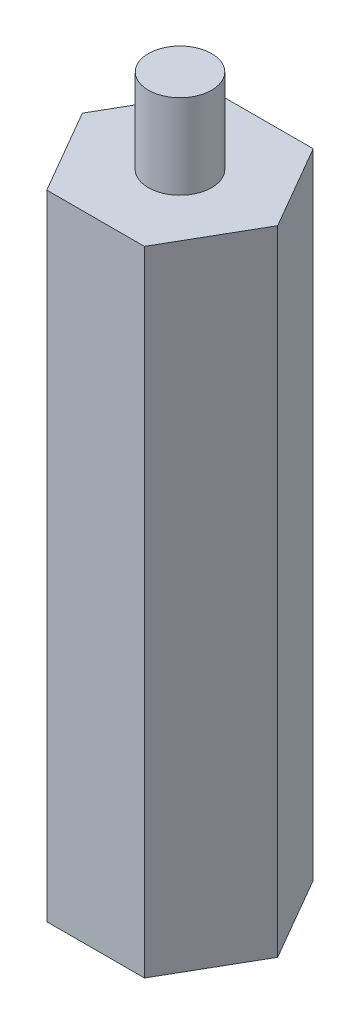
ISO-10303-21;
HEADER;
FILE_DESCRIPTION(('STEP AP214'),'2;1');
FILE_NAME('part.step','',(''),(''),'','','');
FILE_SCHEMA(('AUTOMOTIVE_DESIGN { 1 0 10303 214 1 1 1 1 }'));
ENDSEC;
DATA;
#1=APPLICATION_CONTEXT('core data for automotive mechanical design processes');
#2=APPLICATION_PROTOCOL_DEFINITION('international standard','automotive_design',2000,#1);
#3=PRODUCT_CONTEXT('',#1,'mechanical');
#4=PRODUCT('Part','Part','',(#3));
#5=PRODUCT_RELATED_PRODUCT_CATEGORY('part','',(#4));
#6=PRODUCT_DEFINITION_FORMATION('','',#4);
#7=PRODUCT_DEFINITION_CONTEXT('part definition',#1,'design');
#8=PRODUCT_DEFINITION('design','',#6,#7);
#9=PRODUCT_DEFINITION_SHAPE('','',#8);
#10=(LENGTH_UNIT() NAMED_UNIT(*) SI_UNIT(.MILLI.,.METRE.));
#11=(NAMED_UNIT(*) PLANE_ANGLE_UNIT() SI_UNIT($,.RADIAN.));
#12=(NAMED_UNIT(*) SI_UNIT($,.STERADIAN.) SOLID_ANGLE_UNIT());
#13=UNCERTAINTY_MEASURE_WITH_UNIT(LENGTH_MEASURE(1.E-05),#10,'distance_accuracy_value','');
#14=(GEOMETRIC_REPRESENTATION_CONTEXT(3) GLOBAL_UNCERTAINTY_ASSIGNED_CONTEXT((#13)) GLOBAL_UNIT_ASSIGNED_CONTEXT((#10,
#11,#12)) REPRESENTATION_CONTEXT('',''));
#15=CARTESIAN_POINT('',(0.,0.,0.));
#16=DIRECTION('',(0.,0.,1.));
#17=DIRECTION('',(1.,0.,0.));
#18=AXIS2_PLACEMENT_3D('',#15,#16,#17);
#19=CARTESIAN_POINT('',(9.23759956461125,60.,-0.00936040743649841));
#20=DIRECTION('',(-0.865518312267944,0.,0.500877281506009));
#21=DIRECTION('',(0.500877281506009,0.,0.865518312267944));
#22=AXIS2_PLACEMENT_3D('',#19,#20,#21);
#23=PLANE('',#22);
#24=DIRECTION('',(-0.500877281506009,0.,-0.865518312267944));
#25=VECTOR('',#24,1.);
#26=CARTESIAN_POINT('',(9.23759956461125,0.,-0.00936040743649841));
#27=LINE('',#26,#25);
#28=CARTESIAN_POINT('',(9.23759956461125,0.,-0.00936040743649841));
#29=VERTEX_POINT('',#28);
#30=CARTESIAN_POINT('',(4.61069343167586,0.,-8.00467609665967));
#31=VERTEX_POINT('',#30);
#32=EDGE_CURVE('E122',#29,#31,#27,.T.);
#33=ORIENTED_EDGE('',*,*,#32,.T.);
#34=DIRECTION('',(0.,-1.,0.));
#35=VECTOR('',#34,1.);
#36=CARTESIAN_POINT('',(4.61069343167586,60.,-8.00467609665967));
#37=LINE('',#36,#35);
#38=CARTESIAN_POINT('',(4.61069343167586,60.,-8.00467609665967));
#39=VERTEX_POINT('',#38);
#40=EDGE_CURVE('E39',#39,#31,#37,.T.);
#41=ORIENTED_EDGE('',*,*,#40,.F.);
#42=DIRECTION('',(-0.500877281506009,0.,-0.865518312267944));
#43=VECTOR('',#42,1.);
#44=CARTESIAN_POINT('',(9.23759956461125,60.,-0.00936040743649841));
#45=LINE('',#44,#43);
#46=CARTESIAN_POINT('',(9.23759956461125,60.,-0.00936040743649841));
#47=VERTEX_POINT('',#46);
#48=EDGE_CURVE('E133',#47,#39,#45,.T.);
#49=ORIENTED_EDGE('',*,*,#48,.F.);
#50=DIRECTION('',(0.,-1.,0.));
#51=VECTOR('',#50,1.);
#52=CARTESIAN_POINT('',(9.23759956461125,60.,-0.00936040743649841));
#53=LINE('',#52,#51);
#54=EDGE_CURVE('E118',#47,#29,#53,.T.);
#55=ORIENTED_EDGE('',*,*,#54,.T.);
#56=EDGE_LOOP('',(#33,#41,#49,#55));
#57=FACE_BOUND('',#56,.T.);
#58=ADVANCED_FACE('F36',(#57),#23,.F.);
#59=CARTESIAN_POINT('',(4.61069343167586,60.,-8.00467609665967));
#60=DIRECTION('',(0.00101329382872134,0.,0.999999486617677));
#61=DIRECTION('',(0.999999486617677,0.,-0.00101329382872134));
#62=AXIS2_PLACEMENT_3D('',#59,#60,#61);
#63=PLANE('',#62);
#64=DIRECTION('',(-0.999999486617677,0.,0.00101329382872134));
#65=VECTOR('',#64,1.);
#66=CARTESIAN_POINT('',(4.61069343167586,0.,-8.00467609665967));
#67=LINE('',#66,#65);
#68=CARTESIAN_POINT('',(-4.62690613293537,0.,-7.99531568922318));
#69=VERTEX_POINT('',#68);
#70=EDGE_CURVE('E125',#31,#69,#67,.T.);
#71=ORIENTED_EDGE('',*,*,#70,.T.);
#72=DIRECTION('',(0.,-1.,0.));
#73=VECTOR('',#72,1.);
#74=CARTESIAN_POINT('',(-4.62690613293537,60.,-7.99531568922318));
#75=LINE('',#74,#73);
#76=CARTESIAN_POINT('',(-4.62690613293537,60.,-7.99531568922318));
#77=VERTEX_POINT('',#76);
#78=EDGE_CURVE('E136',#77,#69,#75,.T.);
#79=ORIENTED_EDGE('',*,*,#78,.F.);
#80=DIRECTION('',(-0.999999486617677,0.,0.00101329382872134));
#81=VECTOR('',#80,1.);
#82=CARTESIAN_POINT('',(4.61069343167586,60.,-8.00467609665967));
#83=LINE('',#82,#81);
#84=EDGE_CURVE('E91',#39,#77,#83,.T.);
#85=ORIENTED_EDGE('',*,*,#84,.F.);
#86=ORIENTED_EDGE('',*,*,#40,.T.);
#87=EDGE_LOOP('',(#71,#79,#85,#86));
#88=FACE_BOUND('',#87,.T.);
#89=ADVANCED_FACE('F141',(#88),#63,.F.);
#90=CARTESIAN_POINT('',(-4.62690613293537,60.,-7.99531568922318));
#91=DIRECTION('',(0.866531606096666,0.,0.499122205111667));
#92=DIRECTION('',(0.499122205111667,0.,-0.866531606096666));
#93=AXIS2_PLACEMENT_3D('',#90,#91,#92);
#94=PLANE('',#93);
#95=DIRECTION('',(-0.499122205111667,0.,0.866531606096666));
#96=VECTOR('',#95,1.);
#97=CARTESIAN_POINT('',(-4.62690613293537,0.,-7.99531568922318));
#98=LINE('',#97,#96);
#99=CARTESIAN_POINT('',(-9.23759956461123,0.,0.00936040743649058));
#100=VERTEX_POINT('',#99);
#101=EDGE_CURVE('E128',#69,#100,#98,.T.);
#102=ORIENTED_EDGE('',*,*,#101,.T.);
#103=DIRECTION('',(0.,-1.,0.));
#104=VECTOR('',#103,1.);
#105=CARTESIAN_POINT('',(-9.23759956461123,60.,0.00936040743649058));
#106=LINE('',#105,#104);
#107=CARTESIAN_POINT('',(-9.23759956461123,60.,0.00936040743649058));
#108=VERTEX_POINT('',#107);
#109=EDGE_CURVE('E113',#108,#100,#106,.T.);
#110=ORIENTED_EDGE('',*,*,#109,.F.);
#111=DIRECTION('',(-0.499122205111667,0.,0.866531606096666));
#112=VECTOR('',#111,1.);
#113=CARTESIAN_POINT('',(-4.62690613293537,60.,-7.99531568922318));
#114=LINE('',#113,#112);
#115=EDGE_CURVE('E104',#77,#108,#114,.T.);
#116=ORIENTED_EDGE('',*,*,#115,.F.);
#117=ORIENTED_EDGE('',*,*,#78,.T.);
#118=EDGE_LOOP('',(#102,#110,#116,#117));
#119=FACE_BOUND('',#118,.T.);
#120=ADVANCED_FACE('F147',(#119),#94,.F.);
#121=CARTESIAN_POINT('',(-9.23759956461123,60.,0.00936040743649058));
#122=DIRECTION('',(0.865518312267944,0.,-0.500877281506009));
#123=DIRECTION('',(-0.500877281506009,0.,-0.865518312267944));
#124=AXIS2_PLACEMENT_3D('',#121,#122,#123);
#125=PLANE('',#124);
#126=DIRECTION('',(0.500877281506009,0.,0.865518312267944));
#127=VECTOR('',#126,1.);
#128=CARTESIAN_POINT('',(-9.23759956461123,0.,0.00936040743649058));
#129=LINE('',#128,#127);
#130=CARTESIAN_POINT('',(-4.61069343167583,0.,8.00467609665967));
#131=VERTEX_POINT('',#130);
#132=EDGE_CURVE('E112',#100,#131,#129,.T.);
#133=ORIENTED_EDGE('',*,*,#132,.T.);
#134=DIRECTION('',(0.,-1.,0.));
#135=VECTOR('',#134,1.);
#136=CARTESIAN_POINT('',(-4.61069343167583,60.,8.00467609665967));
#137=LINE('',#136,#135);
#138=CARTESIAN_POINT('',(-4.61069343167583,60.,8.00467609665967));
#139=VERTEX_POINT('',#138);
#140=EDGE_CURVE('E109',#139,#131,#137,.T.);
#141=ORIENTED_EDGE('',*,*,#140,.F.);
#142=DIRECTION('',(0.500877281506009,0.,0.865518312267944));
#143=VECTOR('',#142,1.);
#144=CARTESIAN_POINT('',(-9.23759956461123,60.,0.00936040743649058));
#145=LINE('',#144,#143);
#146=EDGE_CURVE('E98',#108,#139,#145,.T.);
#147=ORIENTED_EDGE('',*,*,#146,.F.);
#148=ORIENTED_EDGE('',*,*,#109,.T.);
#149=EDGE_LOOP('',(#133,#141,#147,#148));
#150=FACE_BOUND('',#149,.T.);
#151=ADVANCED_FACE('F110',(#150),#125,.F.);
#152=CARTESIAN_POINT('',(-4.61069343167583,60.,8.00467609665967));
#153=DIRECTION('',(-0.00101329382872135,0.,-0.999999486617677));
#154=DIRECTION('',(-0.999999486617677,0.,0.00101329382872135));
#155=AXIS2_PLACEMENT_3D('',#152,#153,#154);
#156=PLANE('',#155);
#157=DIRECTION('',(0.999999486617677,0.,-0.00101329382872135));
#158=VECTOR('',#157,1.);
#159=CARTESIAN_POINT('',(-4.61069343167583,0.,8.00467609665967));
#160=LINE('',#159,#158);
#161=CARTESIAN_POINT('',(4.62690613293538,0.,7.99531568922318));
#162=VERTEX_POINT('',#161);
#163=EDGE_CURVE('E76',#131,#162,#160,.T.);
#164=ORIENTED_EDGE('',*,*,#163,.T.);
#165=DIRECTION('',(0.,-1.,0.));
#166=VECTOR('',#165,1.);
#167=CARTESIAN_POINT('',(4.62690613293538,60.,7.99531568922318));
#168=LINE('',#167,#166);
#169=CARTESIAN_POINT('',(4.62690613293538,60.,7.99531568922318));
#170=VERTEX_POINT('',#169);
#171=EDGE_CURVE('E114',#170,#162,#168,.T.);
#172=ORIENTED_EDGE('',*,*,#171,.F.);
#173=DIRECTION('',(0.999999486617677,0.,-0.00101329382872135));
#174=VECTOR('',#173,1.);
#175=CARTESIAN_POINT('',(-4.61069343167583,60.,8.00467609665967));
#176=LINE('',#175,#174);
#177=EDGE_CURVE('E102',#139,#170,#176,.T.);
#178=ORIENTED_EDGE('',*,*,#177,.F.);
#179=ORIENTED_EDGE('',*,*,#140,.T.);
#180=EDGE_LOOP('',(#164,#172,#178,#179));
#181=FACE_BOUND('',#180,.T.);
#182=ADVANCED_FACE('F116',(#181),#156,.F.);
#183=CARTESIAN_POINT('',(4.62690613293538,60.,7.99531568922318));
#184=DIRECTION('',(-0.866531606096665,0.,-0.499122205111668));
#185=DIRECTION('',(-0.499122205111668,0.,0.866531606096665));
#186=AXIS2_PLACEMENT_3D('',#183,#184,#185);
#187=PLANE('',#186);
#188=DIRECTION('',(0.499122205111668,0.,-0.866531606096665));
#189=VECTOR('',#188,1.);
#190=CARTESIAN_POINT('',(4.62690613293538,0.,7.99531568922318));
#191=LINE('',#190,#189);
#192=EDGE_CURVE('E82',#162,#29,#191,.T.);
#193=ORIENTED_EDGE('',*,*,#192,.T.);
#194=ORIENTED_EDGE('',*,*,#54,.F.);
#195=DIRECTION('',(0.499122205111668,0.,-0.866531606096665));
#196=VECTOR('',#195,1.);
#197=CARTESIAN_POINT('',(4.62690613293538,60.,7.99531568922318));
#198=LINE('',#197,#196);
#199=EDGE_CURVE('E53',#170,#47,#198,.T.);
#200=ORIENTED_EDGE('',*,*,#199,.F.);
#201=ORIENTED_EDGE('',*,*,#171,.T.);
#202=EDGE_LOOP('',(#193,#194,#200,#201));
#203=FACE_BOUND('',#202,.T.);
#204=ADVANCED_FACE('F178',(#203),#187,.F.);
#205=CARTESIAN_POINT('',(0.,60.,0.));
#206=DIRECTION('',(0.,1.,0.));
#207=DIRECTION('',(0.,0.,1.));
#208=AXIS2_PLACEMENT_3D('',#205,#206,#207);
#209=PLANE('',#208);
#210=CARTESIAN_POINT('',(0.,60.,0.));
#211=DIRECTION('',(0.,1.,0.));
#212=DIRECTION('',(0.,0.,1.));
#213=AXIS2_PLACEMENT_3D('',#210,#211,#212);
#214=CIRCLE('',#213,3.);
#215=CARTESIAN_POINT('',(0.,60.,3.));
#216=VERTEX_POINT('',#215);
#217=EDGE_CURVE('E11',#216,#216,#214,.T.);
#218=ORIENTED_EDGE('',*,*,#217,.F.);
#219=EDGE_LOOP('',(#218));
#220=FACE_BOUND('',#219,.T.);
#221=ORIENTED_EDGE('',*,*,#48,.T.);
#222=ORIENTED_EDGE('',*,*,#84,.T.);
#223=ORIENTED_EDGE('',*,*,#115,.T.);
#224=ORIENTED_EDGE('',*,*,#146,.T.);
#225=ORIENTED_EDGE('',*,*,#177,.T.);
#226=ORIENTED_EDGE('',*,*,#199,.T.);
#227=EDGE_LOOP('',(#221,#222,#223,#224,#225,#226));
#228=FACE_BOUND('',#227,.T.);
#229=ADVANCED_FACE('F100',(#220,#228),#209,.T.);
#230=CARTESIAN_POINT('',(0.,0.,0.));
#231=DIRECTION('',(0.,1.,0.));
#232=DIRECTION('',(0.,0.,1.));
#233=AXIS2_PLACEMENT_3D('',#230,#231,#232);
#234=PLANE('',#233);
#235=CARTESIAN_POINT('',(0.,0.,0.));
#236=DIRECTION('',(0.,-1.,0.));
#237=DIRECTION('',(0.,0.,-1.));
#238=AXIS2_PLACEMENT_3D('',#235,#236,#237);
#239=CIRCLE('',#238,3.);
#240=CARTESIAN_POINT('',(0.,0.,-3.));
#241=VERTEX_POINT('',#240);
#242=EDGE_CURVE('E154',#241,#241,#239,.T.);
#243=ORIENTED_EDGE('',*,*,#242,.F.);
#244=EDGE_LOOP('',(#243));
#245=FACE_BOUND('',#244,.T.);
#246=ORIENTED_EDGE('',*,*,#32,.F.);
#247=ORIENTED_EDGE('',*,*,#192,.F.);
#248=ORIENTED_EDGE('',*,*,#163,.F.);
#249=ORIENTED_EDGE('',*,*,#132,.F.);
#250=ORIENTED_EDGE('',*,*,#101,.F.);
#251=ORIENTED_EDGE('',*,*,#70,.F.);
#252=EDGE_LOOP('',(#246,#247,#248,#249,#250,#251));
#253=FACE_BOUND('',#252,.T.);
#254=ADVANCED_FACE('F146',(#245,#253),#234,.F.);
#255=CARTESIAN_POINT('',(0.,68.,0.));
#256=DIRECTION('',(0.,-1.,0.));
#257=DIRECTION('',(0.,0.,-1.));
#258=AXIS2_PLACEMENT_3D('',#255,#256,#257);
#259=CYLINDRICAL_SURFACE('',#258,3.);
#260=CARTESIAN_POINT('',(0.,68.,0.));
#261=DIRECTION('',(0.,1.,0.));
#262=DIRECTION('',(0.,0.,1.));
#263=AXIS2_PLACEMENT_3D('',#260,#261,#262);
#264=CIRCLE('',#263,3.);
#265=CARTESIAN_POINT('',(0.,68.,3.));
#266=VERTEX_POINT('',#265);
#267=EDGE_CURVE('E126',#266,#266,#264,.T.);
#268=ORIENTED_EDGE('',*,*,#267,.F.);
#269=EDGE_LOOP('',(#268));
#270=FACE_BOUND('',#269,.T.);
#271=ORIENTED_EDGE('',*,*,#217,.T.);
#272=EDGE_LOOP('',(#271));
#273=FACE_BOUND('',#272,.T.);
#274=ADVANCED_FACE('F170',(#270,#273),#259,.T.);
#275=CARTESIAN_POINT('',(0.,68.,0.));
#276=DIRECTION('',(0.,1.,0.));
#277=DIRECTION('',(0.,0.,1.));
#278=AXIS2_PLACEMENT_3D('',#275,#276,#277);
#279=PLANE('',#278);
#280=ORIENTED_EDGE('',*,*,#267,.T.);
#281=EDGE_LOOP('',(#280));
#282=FACE_BOUND('',#281,.T.);
#283=ADVANCED_FACE('F165',(#282),#279,.T.);
#284=CARTESIAN_POINT('',(0.,8.,0.));
#285=DIRECTION('',(0.,-1.,0.));
#286=DIRECTION('',(0.,0.,-1.));
#287=AXIS2_PLACEMENT_3D('',#284,#285,#286);
#288=CYLINDRICAL_SURFACE('',#287,3.);
#289=CARTESIAN_POINT('',(0.,8.,0.));
#290=DIRECTION('',(0.,-1.,0.));
#291=DIRECTION('',(0.,0.,-1.));
#292=AXIS2_PLACEMENT_3D('',#289,#290,#291);
#293=CIRCLE('',#292,3.);
#294=CARTESIAN_POINT('',(0.,8.,-3.));
#295=VERTEX_POINT('',#294);
#296=EDGE_CURVE('E153',#295,#295,#293,.T.);
#297=ORIENTED_EDGE('',*,*,#296,.F.);
#298=EDGE_LOOP('',(#297));
#299=FACE_BOUND('',#298,.T.);
#300=ORIENTED_EDGE('',*,*,#242,.T.);
#301=EDGE_LOOP('',(#300));
#302=FACE_BOUND('',#301,.T.);
#303=ADVANCED_FACE('F162',(#299,#302),#288,.F.);
#304=CARTESIAN_POINT('',(0.,8.,0.));
#305=DIRECTION('',(0.,-1.,0.));
#306=DIRECTION('',(0.,0.,-1.));
#307=AXIS2_PLACEMENT_3D('',#304,#305,#306);
#308=PLANE('',#307);
#309=ORIENTED_EDGE('',*,*,#296,.T.);
#310=EDGE_LOOP('',(#309));
#311=FACE_BOUND('',#310,.T.);
#312=ADVANCED_FACE('F160',(#311),#308,.T.);
#313=CLOSED_SHELL('',(#58,#89,#120,#151,#182,#204,#229,#254,#274,#283,#303,#312));
#314=MANIFOLD_SOLID_BREP('B2',#313);
#315=ADVANCED_BREP_SHAPE_REPRESENTATION('',(#18,#314),#14);
#316=SHAPE_DEFINITION_REPRESENTATION(#9,#315);
ENDSEC;
END-ISO-10303-21;
